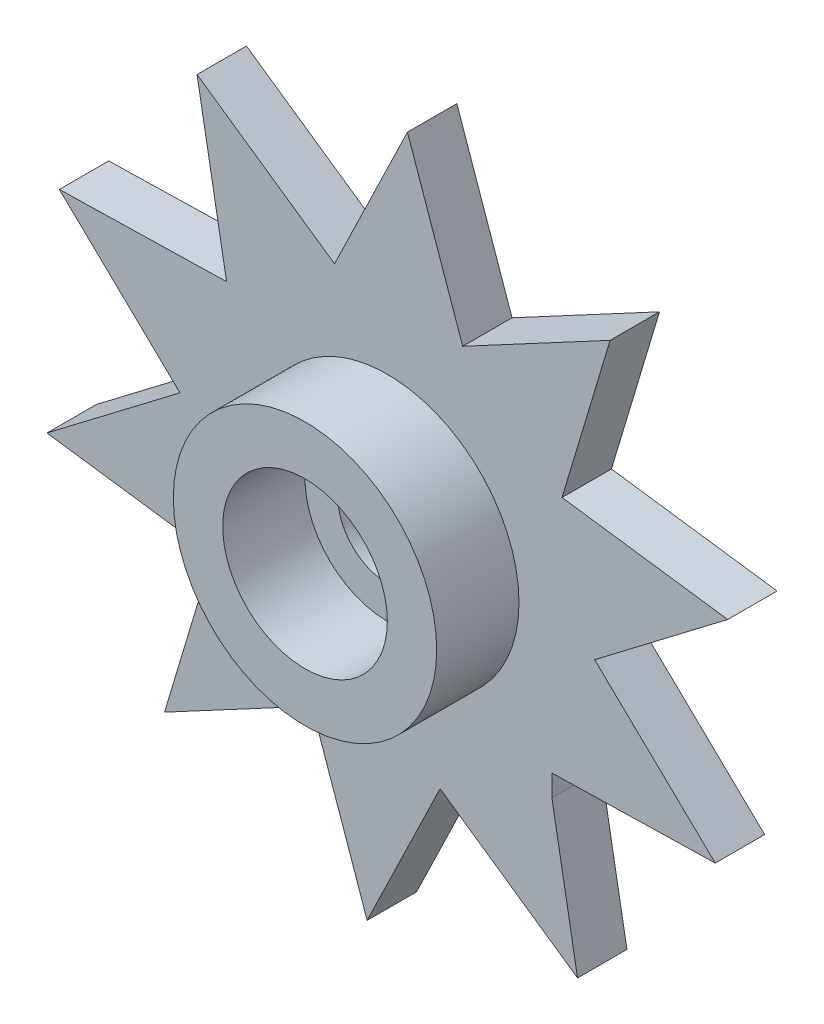
ISO-10303-21;
HEADER;
FILE_DESCRIPTION(('STEP AP214'),'2;1');
FILE_NAME('part.step','',(''),(''),'','','');
FILE_SCHEMA(('AUTOMOTIVE_DESIGN { 1 0 10303 214 1 1 1 1 }'));
ENDSEC;
DATA;
#1=APPLICATION_CONTEXT('core data for automotive mechanical design processes');
#2=APPLICATION_PROTOCOL_DEFINITION('international standard','automotive_design',2000,#1);
#3=PRODUCT_CONTEXT('',#1,'mechanical');
#4=PRODUCT('Part','Part','',(#3));
#5=PRODUCT_RELATED_PRODUCT_CATEGORY('part','',(#4));
#6=PRODUCT_DEFINITION_FORMATION('','',#4);
#7=PRODUCT_DEFINITION_CONTEXT('part definition',#1,'design');
#8=PRODUCT_DEFINITION('design','',#6,#7);
#9=PRODUCT_DEFINITION_SHAPE('','',#8);
#10=(LENGTH_UNIT() NAMED_UNIT(*) SI_UNIT(.MILLI.,.METRE.));
#11=(NAMED_UNIT(*) PLANE_ANGLE_UNIT() SI_UNIT($,.RADIAN.));
#12=(NAMED_UNIT(*) SI_UNIT($,.STERADIAN.) SOLID_ANGLE_UNIT());
#13=UNCERTAINTY_MEASURE_WITH_UNIT(LENGTH_MEASURE(1.E-05),#10,'distance_accuracy_value','');
#14=(GEOMETRIC_REPRESENTATION_CONTEXT(3) GLOBAL_UNCERTAINTY_ASSIGNED_CONTEXT((#13)) GLOBAL_UNIT_ASSIGNED_CONTEXT((#10,
#11,#12)) REPRESENTATION_CONTEXT('',''));
#15=CARTESIAN_POINT('',(0.,0.,0.));
#16=DIRECTION('',(0.,0.,1.));
#17=DIRECTION('',(1.,0.,0.));
#18=AXIS2_PLACEMENT_3D('',#15,#16,#17);
#19=CARTESIAN_POINT('',(-27.0977879554297,20.4023803394427,-1.5));
#20=DIRECTION('',(0.,0.,-1.));
#21=DIRECTION('',(-1.,0.,0.));
#22=AXIS2_PLACEMENT_3D('',#19,#20,#21);
#23=PLANE('',#22);
#24=DIRECTION('',(0.435997280474223,0.899947982618486,0.));
#25=VECTOR('',#24,1.);
#26=CARTESIAN_POINT('',(-29.312442593353,15.8310812445769,-1.5));
#27=LINE('',#26,#25);
#28=CARTESIAN_POINT('',(-29.312442593353,15.8310812445769,-1.5));
#29=VERTEX_POINT('',#28);
#30=CARTESIAN_POINT('',(-27.0977879554297,20.4023803394427,-1.5));
#31=VERTEX_POINT('',#30);
#32=EDGE_CURVE('E192',#29,#31,#27,.T.);
#33=ORIENTED_EDGE('',*,*,#32,.F.);
#34=DIRECTION('',(0.33034581233094,-0.943859970692375,0.));
#35=VECTOR('',#34,1.);
#36=CARTESIAN_POINT('',(-30.9904390360479,20.6254319343846,-1.5));
#37=LINE('',#36,#35);
#38=CARTESIAN_POINT('',(-30.9904390360479,20.6254319343846,-1.5));
#39=VERTEX_POINT('',#38);
#40=EDGE_CURVE('E185',#39,#29,#37,.T.);
#41=ORIENTED_EDGE('',*,*,#40,.F.);
#42=DIRECTION('',(0.881705360786623,0.471800441670131,0.));
#43=VECTOR('',#42,1.);
#44=CARTESIAN_POINT('',(-35.4690744729797,18.2289146042202,-1.5));
#45=LINE('',#44,#43);
#46=CARTESIAN_POINT('',(-35.4690744729797,18.2289146042202,-1.5));
#47=VERTEX_POINT('',#46);
#48=EDGE_CURVE('E253',#47,#39,#45,.T.);
#49=ORIENTED_EDGE('',*,*,#48,.F.);
#50=DIRECTION('',(-0.287531593863195,-0.95777115352807,0.));
#51=VECTOR('',#50,1.);
#52=CARTESIAN_POINT('',(-34.0085534855665,23.0939273566354,-1.5));
#53=LINE('',#52,#51);
#54=CARTESIAN_POINT('',(-34.0085534855665,23.0939273566354,-1.5));
#55=VERTEX_POINT('',#54);
#56=EDGE_CURVE('E250',#55,#47,#53,.T.);
#57=ORIENTED_EDGE('',*,*,#56,.F.);
#58=DIRECTION('',(0.990631962346079,-0.136558834127848,0.));
#59=VECTOR('',#58,1.);
#60=CARTESIAN_POINT('',(-39.0404831994656,23.7875799756322,-1.5));
#61=LINE('',#60,#59);
#62=CARTESIAN_POINT('',(-39.0404831994656,23.7875799756322,-1.5));
#63=VERTEX_POINT('',#62);
#64=EDGE_CURVE('E247',#63,#55,#61,.T.);
#65=ORIENTED_EDGE('',*,*,#64,.F.);
#66=DIRECTION('',(-0.795581704514586,-0.605846310083396,0.));
#67=VECTOR('',#66,1.);
#68=CARTESIAN_POINT('',(-34.9993141568231,26.8649852741893,-1.5));
#69=LINE('',#68,#67);
#70=CARTESIAN_POINT('',(-34.9993141568231,26.8649852741893,-1.5));
#71=VERTEX_POINT('',#70);
#72=EDGE_CURVE('E244',#71,#63,#69,.T.);
#73=ORIENTED_EDGE('',*,*,#72,.F.);
#74=DIRECTION('',(0.721170823852476,-0.692757275547461,0.));
#75=VECTOR('',#74,1.);
#76=CARTESIAN_POINT('',(-38.66251203676,30.3838561147205,-1.5));
#77=LINE('',#76,#75);
#78=CARTESIAN_POINT('',(-38.66251203676,30.3838561147205,-1.5));
#79=VERTEX_POINT('',#78);
#80=EDGE_CURVE('E241',#79,#71,#77,.T.);
#81=ORIENTED_EDGE('',*,*,#80,.F.);
#82=DIRECTION('',(-0.999746645592742,-0.0225087677596958,0.));
#83=VECTOR('',#82,1.);
#84=CARTESIAN_POINT('',(-33.5842841515882,30.4981897337449,-1.5));
#85=LINE('',#84,#83);
#86=CARTESIAN_POINT('',(-33.5842841515882,30.4981897337449,-1.5));
#87=VERTEX_POINT('',#86);
#88=EDGE_CURVE('E238',#87,#79,#85,.T.);
#89=ORIENTED_EDGE('',*,*,#88,.F.);
#90=DIRECTION('',(0.176246943085122,-0.984345983408857,0.));
#91=VECTOR('',#90,1.);
#92=CARTESIAN_POINT('',(-34.4795331066723,35.4981897204815,-1.5));
#93=LINE('',#92,#91);
#94=CARTESIAN_POINT('',(-34.4795331066723,35.4981897204815,-1.5));
#95=VERTEX_POINT('',#94);
#96=EDGE_CURVE('E235',#95,#87,#93,.T.);
#97=ORIENTED_EDGE('',*,*,#96,.F.);
#98=DIRECTION('',(-0.822042348583234,0.569426357956638,0.));
#99=VECTOR('',#98,1.);
#100=CARTESIAN_POINT('',(-30.3039568240703,32.6057801030573,-1.5));
#101=LINE('',#100,#99);
#102=CARTESIAN_POINT('',(-30.3039568240703,32.6057801030573,-1.5));
#103=VERTEX_POINT('',#102);
#104=EDGE_CURVE('E232',#103,#95,#101,.T.);
#105=ORIENTED_EDGE('',*,*,#104,.F.);
#106=DIRECTION('',(-0.435997280515322,-0.899947982598574,0.));
#107=VECTOR('',#106,1.);
#108=CARTESIAN_POINT('',(-28.089302185647,37.1770791984231,-1.5));
#109=LINE('',#108,#107);
#110=CARTESIAN_POINT('',(-28.089302185647,37.1770791984231,-1.5));
#111=VERTEX_POINT('',#110);
#112=EDGE_CURVE('E229',#111,#103,#109,.T.);
#113=ORIENTED_EDGE('',*,*,#112,.F.);
#114=DIRECTION('',(-0.330345812243248,0.943859970723067,0.));
#115=VECTOR('',#114,1.);
#116=CARTESIAN_POINT('',(-26.4113057434521,32.3827285086154,-1.5));
#117=LINE('',#116,#115);
#118=CARTESIAN_POINT('',(-26.4113057434521,32.3827285086154,-1.5));
#119=VERTEX_POINT('',#118);
#120=EDGE_CURVE('E226',#119,#111,#117,.T.);
#121=ORIENTED_EDGE('',*,*,#120,.F.);
#122=DIRECTION('',(-0.881705360827571,-0.471800441593608,0.));
#123=VECTOR('',#122,1.);
#124=CARTESIAN_POINT('',(-21.9326703065203,34.7792458382798,-1.5));
#125=LINE('',#124,#123);
#126=CARTESIAN_POINT('',(-21.9326703065203,34.7792458382798,-1.5));
#127=VERTEX_POINT('',#126);
#128=EDGE_CURVE('E223',#127,#119,#125,.T.);
#129=ORIENTED_EDGE('',*,*,#128,.F.);
#130=DIRECTION('',(0.287531593800007,0.95777115354704,0.));
#131=VECTOR('',#130,1.);
#132=CARTESIAN_POINT('',(-23.3931912934335,29.9142330863646,-1.5));
#133=LINE('',#132,#131);
#134=CARTESIAN_POINT('',(-23.3931912934335,29.9142330863646,-1.5));
#135=VERTEX_POINT('',#134);
#136=EDGE_CURVE('E220',#135,#127,#133,.T.);
#137=ORIENTED_EDGE('',*,*,#136,.F.);
#138=DIRECTION('',(-0.990631962346079,0.136558834127849,0.));
#139=VECTOR('',#138,1.);
#140=CARTESIAN_POINT('',(-18.3612615795344,29.2205804673678,-1.5));
#141=LINE('',#140,#139);
#142=CARTESIAN_POINT('',(-18.3612615795344,29.2205804673678,-1.5));
#143=VERTEX_POINT('',#142);
#144=EDGE_CURVE('E217',#143,#135,#141,.T.);
#145=ORIENTED_EDGE('',*,*,#144,.F.);
#146=DIRECTION('',(0.795581704503271,0.605846310098254,0.));
#147=VECTOR('',#146,1.);
#148=CARTESIAN_POINT('',(-22.4024306226769,26.1431751683108,-1.5));
#149=LINE('',#148,#147);
#150=CARTESIAN_POINT('',(-22.4024306226769,26.1431751683108,-1.5));
#151=VERTEX_POINT('',#150);
#152=EDGE_CURVE('E214',#151,#143,#149,.T.);
#153=ORIENTED_EDGE('',*,*,#152,.F.);
#154=DIRECTION('',(-0.721170823899714,0.692757275498285,0.));
#155=VECTOR('',#154,1.);
#156=CARTESIAN_POINT('',(-18.73923274224,22.6243043277795,-1.5));
#157=LINE('',#156,#155);
#158=CARTESIAN_POINT('',(-18.73923274224,22.6243043277795,-1.5));
#159=VERTEX_POINT('',#158);
#160=EDGE_CURVE('E211',#159,#151,#157,.T.);
#161=ORIENTED_EDGE('',*,*,#160,.F.);
#162=DIRECTION('',(0.999746645635961,0.0225087658401004,0.));
#163=VECTOR('',#162,1.);
#164=CARTESIAN_POINT('',(-23.8174606317334,22.5099707184134,-1.5));
#165=LINE('',#164,#163);
#166=CARTESIAN_POINT('',(-23.7008723899989,22.5125956408818,-1.5));
#167=VERTEX_POINT('',#166);
#168=EDGE_CURVE('E209',#167,#159,#165,.T.);
#169=ORIENTED_EDGE('',*,*,#168,.F.);
#170=DIRECTION('',(4.08548727608119E-10,1.,0.));
#171=VECTOR('',#170,1.);
#172=CARTESIAN_POINT('',(-23.700872390266,21.8588208889524,-1.5));
#173=LINE('',#172,#171);
#174=CARTESIAN_POINT('',(-23.700872390266,21.8588208889524,-1.5));
#175=VERTEX_POINT('',#174);
#176=EDGE_CURVE('E11',#167,#175,#173,.F.);
#177=ORIENTED_EDGE('',*,*,#176,.T.);
#178=DIRECTION('',(-0.176246943484241,0.984345983337395,0.));
#179=VECTOR('',#178,1.);
#180=CARTESIAN_POINT('',(-22.9222116728277,17.5099707220185,-1.5));
#181=LINE('',#180,#179);
#182=CARTESIAN_POINT('',(-22.9222116728277,17.5099707220185,-1.5));
#183=VERTEX_POINT('',#182);
#184=EDGE_CURVE('E195',#183,#175,#181,.T.);
#185=ORIENTED_EDGE('',*,*,#184,.F.);
#186=DIRECTION('',(0.822042348583234,-0.569426357956637,0.));
#187=VECTOR('',#186,1.);
#188=CARTESIAN_POINT('',(-27.0977879554297,20.4023803394427,-1.5));
#189=LINE('',#188,#187);
#190=EDGE_CURVE('E177',#31,#183,#189,.T.);
#191=ORIENTED_EDGE('',*,*,#190,.F.);
#192=EDGE_LOOP('',(#33,#41,#49,#57,#65,#73,#81,#89,#97,#105,#113,#121,#129,#137,#145,#153,#161,
#169,#177,#185,#191));
#193=FACE_BOUND('',#192,.T.);
#194=CARTESIAN_POINT('',(-28.70087239,26.504080221,-1.5));
#195=DIRECTION('',(0.,0.,1.));
#196=DIRECTION('',(1.,0.,0.));
#197=AXIS2_PLACEMENT_3D('',#194,#195,#196);
#198=CIRCLE('',#197,1.50000000000001);
#199=CARTESIAN_POINT('',(-27.20087239,26.504080221,-1.5));
#200=VERTEX_POINT('',#199);
#201=EDGE_CURVE('E660',#200,#200,#198,.T.);
#202=ORIENTED_EDGE('',*,*,#201,.T.);
#203=EDGE_LOOP('',(#202));
#204=FACE_BOUND('',#203,.T.);
#205=ADVANCED_FACE('F33',(#193,#204),#23,.T.);
#206=CARTESIAN_POINT('',(-29.312442593353,15.8310812445769,-1.5));
#207=DIRECTION('',(0.899947982618485,-0.435997280474223,0.));
#208=DIRECTION('',(0.435997280474223,0.899947982618486,0.));
#209=AXIS2_PLACEMENT_3D('',#206,#207,#208);
#210=PLANE('',#209);
#211=DIRECTION('',(0.435997280474223,0.899947982618486,0.));
#212=VECTOR('',#211,1.);
#213=CARTESIAN_POINT('',(-29.312442593353,15.8310812445769,0.));
#214=LINE('',#213,#212);
#215=CARTESIAN_POINT('',(-29.312442593353,15.8310812445769,0.));
#216=VERTEX_POINT('',#215);
#217=CARTESIAN_POINT('',(-27.0977879554297,20.4023803394427,0.));
#218=VERTEX_POINT('',#217);
#219=EDGE_CURVE('E257',#216,#218,#214,.T.);
#220=ORIENTED_EDGE('',*,*,#219,.F.);
#221=DIRECTION('',(0.,0.,1.));
#222=VECTOR('',#221,1.);
#223=CARTESIAN_POINT('',(-29.312442593353,15.8310812445769,-1.5));
#224=LINE('',#223,#222);
#225=EDGE_CURVE('E198',#29,#216,#224,.T.);
#226=ORIENTED_EDGE('',*,*,#225,.F.);
#227=ORIENTED_EDGE('',*,*,#32,.T.);
#228=DIRECTION('',(0.,0.,1.));
#229=VECTOR('',#228,1.);
#230=CARTESIAN_POINT('',(-27.0977879554297,20.4023803394427,-1.5));
#231=LINE('',#230,#229);
#232=EDGE_CURVE('E174',#31,#218,#231,.T.);
#233=ORIENTED_EDGE('',*,*,#232,.T.);
#234=EDGE_LOOP('',(#220,#226,#227,#233));
#235=FACE_BOUND('',#234,.T.);
#236=ADVANCED_FACE('F197',(#235),#210,.T.);
#237=CARTESIAN_POINT('',(-30.9904390360479,20.6254319343846,-1.5));
#238=DIRECTION('',(-0.943859970692375,-0.33034581233094,0.));
#239=DIRECTION('',(0.33034581233094,-0.943859970692375,0.));
#240=AXIS2_PLACEMENT_3D('',#237,#238,#239);
#241=PLANE('',#240);
#242=DIRECTION('',(0.33034581233094,-0.943859970692375,0.));
#243=VECTOR('',#242,1.);
#244=CARTESIAN_POINT('',(-30.9904390360479,20.6254319343846,0.));
#245=LINE('',#244,#243);
#246=CARTESIAN_POINT('',(-30.9904390360479,20.6254319343846,0.));
#247=VERTEX_POINT('',#246);
#248=EDGE_CURVE('E199',#247,#216,#245,.T.);
#249=ORIENTED_EDGE('',*,*,#248,.F.);
#250=DIRECTION('',(0.,0.,1.));
#251=VECTOR('',#250,1.);
#252=CARTESIAN_POINT('',(-30.9904390360479,20.6254319343846,-1.5));
#253=LINE('',#252,#251);
#254=EDGE_CURVE('E310',#39,#247,#253,.T.);
#255=ORIENTED_EDGE('',*,*,#254,.F.);
#256=ORIENTED_EDGE('',*,*,#40,.T.);
#257=ORIENTED_EDGE('',*,*,#225,.T.);
#258=EDGE_LOOP('',(#249,#255,#256,#257));
#259=FACE_BOUND('',#258,.T.);
#260=ADVANCED_FACE('F356',(#259),#241,.T.);
#261=CARTESIAN_POINT('',(-35.4690744729797,18.2289146042202,-1.5));
#262=DIRECTION('',(0.471800441670131,-0.881705360786623,0.));
#263=DIRECTION('',(0.881705360786623,0.471800441670131,0.));
#264=AXIS2_PLACEMENT_3D('',#261,#262,#263);
#265=PLANE('',#264);
#266=DIRECTION('',(0.881705360786623,0.471800441670131,0.));
#267=VECTOR('',#266,1.);
#268=CARTESIAN_POINT('',(-35.4690744729797,18.2289146042202,0.));
#269=LINE('',#268,#267);
#270=CARTESIAN_POINT('',(-35.4690744729797,18.2289146042202,0.));
#271=VERTEX_POINT('',#270);
#272=EDGE_CURVE('E202',#271,#247,#269,.T.);
#273=ORIENTED_EDGE('',*,*,#272,.F.);
#274=DIRECTION('',(0.,0.,1.));
#275=VECTOR('',#274,1.);
#276=CARTESIAN_POINT('',(-35.4690744729797,18.2289146042202,-1.5));
#277=LINE('',#276,#275);
#278=EDGE_CURVE('E312',#47,#271,#277,.T.);
#279=ORIENTED_EDGE('',*,*,#278,.F.);
#280=ORIENTED_EDGE('',*,*,#48,.T.);
#281=ORIENTED_EDGE('',*,*,#254,.T.);
#282=EDGE_LOOP('',(#273,#279,#280,#281));
#283=FACE_BOUND('',#282,.T.);
#284=ADVANCED_FACE('F438',(#283),#265,.T.);
#285=CARTESIAN_POINT('',(-34.0085534855665,23.0939273566354,-1.5));
#286=DIRECTION('',(-0.957771153528071,0.287531593863195,0.));
#287=DIRECTION('',(-0.287531593863195,-0.957771153528071,0.));
#288=AXIS2_PLACEMENT_3D('',#285,#286,#287);
#289=PLANE('',#288);
#290=DIRECTION('',(-0.287531593863195,-0.95777115352807,0.));
#291=VECTOR('',#290,1.);
#292=CARTESIAN_POINT('',(-34.0085534855665,23.0939273566354,0.));
#293=LINE('',#292,#291);
#294=CARTESIAN_POINT('',(-34.0085534855665,23.0939273566354,0.));
#295=VERTEX_POINT('',#294);
#296=EDGE_CURVE('E303',#295,#271,#293,.T.);
#297=ORIENTED_EDGE('',*,*,#296,.F.);
#298=DIRECTION('',(0.,0.,1.));
#299=VECTOR('',#298,1.);
#300=CARTESIAN_POINT('',(-34.0085534855665,23.0939273566354,-1.5));
#301=LINE('',#300,#299);
#302=EDGE_CURVE('E314',#55,#295,#301,.T.);
#303=ORIENTED_EDGE('',*,*,#302,.F.);
#304=ORIENTED_EDGE('',*,*,#56,.T.);
#305=ORIENTED_EDGE('',*,*,#278,.T.);
#306=EDGE_LOOP('',(#297,#303,#304,#305));
#307=FACE_BOUND('',#306,.T.);
#308=ADVANCED_FACE('F363',(#307),#289,.T.);
#309=CARTESIAN_POINT('',(-39.0404831994656,23.7875799756322,-1.5));
#310=DIRECTION('',(-0.136558834127848,-0.990631962346079,0.));
#311=DIRECTION('',(0.990631962346079,-0.136558834127848,0.));
#312=AXIS2_PLACEMENT_3D('',#309,#310,#311);
#313=PLANE('',#312);
#314=DIRECTION('',(0.990631962346079,-0.136558834127848,0.));
#315=VECTOR('',#314,1.);
#316=CARTESIAN_POINT('',(-39.0404831994656,23.7875799756322,0.));
#317=LINE('',#316,#315);
#318=CARTESIAN_POINT('',(-39.0404831994656,23.7875799756322,0.));
#319=VERTEX_POINT('',#318);
#320=EDGE_CURVE('E300',#319,#295,#317,.T.);
#321=ORIENTED_EDGE('',*,*,#320,.F.);
#322=DIRECTION('',(0.,0.,1.));
#323=VECTOR('',#322,1.);
#324=CARTESIAN_POINT('',(-39.0404831994656,23.7875799756322,-1.5));
#325=LINE('',#324,#323);
#326=EDGE_CURVE('E316',#63,#319,#325,.T.);
#327=ORIENTED_EDGE('',*,*,#326,.F.);
#328=ORIENTED_EDGE('',*,*,#64,.T.);
#329=ORIENTED_EDGE('',*,*,#302,.T.);
#330=EDGE_LOOP('',(#321,#327,#328,#329));
#331=FACE_BOUND('',#330,.T.);
#332=ADVANCED_FACE('F366',(#331),#313,.T.);
#333=CARTESIAN_POINT('',(-34.9993141568231,26.8649852741893,-1.5));
#334=DIRECTION('',(-0.605846310083396,0.795581704514586,0.));
#335=DIRECTION('',(-0.795581704514586,-0.605846310083396,0.));
#336=AXIS2_PLACEMENT_3D('',#333,#334,#335);
#337=PLANE('',#336);
#338=DIRECTION('',(-0.795581704514586,-0.605846310083396,0.));
#339=VECTOR('',#338,1.);
#340=CARTESIAN_POINT('',(-34.9993141568231,26.8649852741893,0.));
#341=LINE('',#340,#339);
#342=CARTESIAN_POINT('',(-34.9993141568231,26.8649852741893,0.));
#343=VERTEX_POINT('',#342);
#344=EDGE_CURVE('E297',#343,#319,#341,.T.);
#345=ORIENTED_EDGE('',*,*,#344,.F.);
#346=DIRECTION('',(0.,0.,1.));
#347=VECTOR('',#346,1.);
#348=CARTESIAN_POINT('',(-34.9993141568231,26.8649852741893,-1.5));
#349=LINE('',#348,#347);
#350=EDGE_CURVE('E318',#71,#343,#349,.T.);
#351=ORIENTED_EDGE('',*,*,#350,.F.);
#352=ORIENTED_EDGE('',*,*,#72,.T.);
#353=ORIENTED_EDGE('',*,*,#326,.T.);
#354=EDGE_LOOP('',(#345,#351,#352,#353));
#355=FACE_BOUND('',#354,.T.);
#356=ADVANCED_FACE('F371',(#355),#337,.T.);
#357=CARTESIAN_POINT('',(-38.66251203676,30.3838561147205,-1.5));
#358=DIRECTION('',(-0.692757275547461,-0.721170823852476,0.));
#359=DIRECTION('',(0.721170823852476,-0.692757275547461,0.));
#360=AXIS2_PLACEMENT_3D('',#357,#358,#359);
#361=PLANE('',#360);
#362=DIRECTION('',(0.721170823852476,-0.692757275547461,0.));
#363=VECTOR('',#362,1.);
#364=CARTESIAN_POINT('',(-38.66251203676,30.3838561147205,0.));
#365=LINE('',#364,#363);
#366=CARTESIAN_POINT('',(-38.66251203676,30.3838561147205,0.));
#367=VERTEX_POINT('',#366);
#368=EDGE_CURVE('E294',#367,#343,#365,.T.);
#369=ORIENTED_EDGE('',*,*,#368,.F.);
#370=DIRECTION('',(0.,0.,1.));
#371=VECTOR('',#370,1.);
#372=CARTESIAN_POINT('',(-38.66251203676,30.3838561147205,-1.5));
#373=LINE('',#372,#371);
#374=EDGE_CURVE('E320',#79,#367,#373,.T.);
#375=ORIENTED_EDGE('',*,*,#374,.F.);
#376=ORIENTED_EDGE('',*,*,#80,.T.);
#377=ORIENTED_EDGE('',*,*,#350,.T.);
#378=EDGE_LOOP('',(#369,#375,#376,#377));
#379=FACE_BOUND('',#378,.T.);
#380=ADVANCED_FACE('F374',(#379),#361,.T.);
#381=CARTESIAN_POINT('',(-33.5842841515882,30.4981897337449,-1.5));
#382=DIRECTION('',(-0.0225087677596958,0.999746645592742,0.));
#383=DIRECTION('',(-0.999746645592742,-0.0225087677596958,0.));
#384=AXIS2_PLACEMENT_3D('',#381,#382,#383);
#385=PLANE('',#384);
#386=DIRECTION('',(-0.999746645592742,-0.0225087677596958,0.));
#387=VECTOR('',#386,1.);
#388=CARTESIAN_POINT('',(-33.5842841515882,30.4981897337449,0.));
#389=LINE('',#388,#387);
#390=CARTESIAN_POINT('',(-33.5842841515882,30.4981897337449,0.));
#391=VERTEX_POINT('',#390);
#392=EDGE_CURVE('E291',#391,#367,#389,.T.);
#393=ORIENTED_EDGE('',*,*,#392,.F.);
#394=DIRECTION('',(0.,0.,1.));
#395=VECTOR('',#394,1.);
#396=CARTESIAN_POINT('',(-33.5842841515882,30.4981897337449,-1.5));
#397=LINE('',#396,#395);
#398=EDGE_CURVE('E322',#87,#391,#397,.T.);
#399=ORIENTED_EDGE('',*,*,#398,.F.);
#400=ORIENTED_EDGE('',*,*,#88,.T.);
#401=ORIENTED_EDGE('',*,*,#374,.T.);
#402=EDGE_LOOP('',(#393,#399,#400,#401));
#403=FACE_BOUND('',#402,.T.);
#404=ADVANCED_FACE('F379',(#403),#385,.T.);
#405=CARTESIAN_POINT('',(-34.4795331066723,35.4981897204815,-1.5));
#406=DIRECTION('',(-0.984345983408857,-0.176246943085122,0.));
#407=DIRECTION('',(0.176246943085122,-0.984345983408857,0.));
#408=AXIS2_PLACEMENT_3D('',#405,#406,#407);
#409=PLANE('',#408);
#410=DIRECTION('',(0.176246943085122,-0.984345983408857,0.));
#411=VECTOR('',#410,1.);
#412=CARTESIAN_POINT('',(-34.4795331066723,35.4981897204815,0.));
#413=LINE('',#412,#411);
#414=CARTESIAN_POINT('',(-34.4795331066723,35.4981897204815,0.));
#415=VERTEX_POINT('',#414);
#416=EDGE_CURVE('E288',#415,#391,#413,.T.);
#417=ORIENTED_EDGE('',*,*,#416,.F.);
#418=DIRECTION('',(0.,0.,1.));
#419=VECTOR('',#418,1.);
#420=CARTESIAN_POINT('',(-34.4795331066723,35.4981897204815,-1.5));
#421=LINE('',#420,#419);
#422=EDGE_CURVE('E324',#95,#415,#421,.T.);
#423=ORIENTED_EDGE('',*,*,#422,.F.);
#424=ORIENTED_EDGE('',*,*,#96,.T.);
#425=ORIENTED_EDGE('',*,*,#398,.T.);
#426=EDGE_LOOP('',(#417,#423,#424,#425));
#427=FACE_BOUND('',#426,.T.);
#428=ADVANCED_FACE('F382',(#427),#409,.T.);
#429=CARTESIAN_POINT('',(-30.3039568240703,32.6057801030573,-1.5));
#430=DIRECTION('',(0.569426357956638,0.822042348583234,0.));
#431=DIRECTION('',(-0.822042348583234,0.569426357956638,0.));
#432=AXIS2_PLACEMENT_3D('',#429,#430,#431);
#433=PLANE('',#432);
#434=DIRECTION('',(-0.822042348583234,0.569426357956638,0.));
#435=VECTOR('',#434,1.);
#436=CARTESIAN_POINT('',(-30.3039568240703,32.6057801030573,0.));
#437=LINE('',#436,#435);
#438=CARTESIAN_POINT('',(-30.3039568240703,32.6057801030573,0.));
#439=VERTEX_POINT('',#438);
#440=EDGE_CURVE('E285',#439,#415,#437,.T.);
#441=ORIENTED_EDGE('',*,*,#440,.F.);
#442=DIRECTION('',(0.,0.,1.));
#443=VECTOR('',#442,1.);
#444=CARTESIAN_POINT('',(-30.3039568240703,32.6057801030573,-1.5));
#445=LINE('',#444,#443);
#446=EDGE_CURVE('E326',#103,#439,#445,.T.);
#447=ORIENTED_EDGE('',*,*,#446,.F.);
#448=ORIENTED_EDGE('',*,*,#104,.T.);
#449=ORIENTED_EDGE('',*,*,#422,.T.);
#450=EDGE_LOOP('',(#441,#447,#448,#449));
#451=FACE_BOUND('',#450,.T.);
#452=ADVANCED_FACE('F387',(#451),#433,.T.);
#453=CARTESIAN_POINT('',(-28.089302185647,37.1770791984231,-1.5));
#454=DIRECTION('',(-0.899947982598574,0.435997280515322,0.));
#455=DIRECTION('',(-0.435997280515322,-0.899947982598574,0.));
#456=AXIS2_PLACEMENT_3D('',#453,#454,#455);
#457=PLANE('',#456);
#458=DIRECTION('',(-0.435997280515322,-0.899947982598574,0.));
#459=VECTOR('',#458,1.);
#460=CARTESIAN_POINT('',(-28.089302185647,37.1770791984231,0.));
#461=LINE('',#460,#459);
#462=CARTESIAN_POINT('',(-28.089302185647,37.1770791984231,0.));
#463=VERTEX_POINT('',#462);
#464=EDGE_CURVE('E282',#463,#439,#461,.T.);
#465=ORIENTED_EDGE('',*,*,#464,.F.);
#466=DIRECTION('',(0.,0.,1.));
#467=VECTOR('',#466,1.);
#468=CARTESIAN_POINT('',(-28.089302185647,37.1770791984231,-1.5));
#469=LINE('',#468,#467);
#470=EDGE_CURVE('E328',#111,#463,#469,.T.);
#471=ORIENTED_EDGE('',*,*,#470,.F.);
#472=ORIENTED_EDGE('',*,*,#112,.T.);
#473=ORIENTED_EDGE('',*,*,#446,.T.);
#474=EDGE_LOOP('',(#465,#471,#472,#473));
#475=FACE_BOUND('',#474,.T.);
#476=ADVANCED_FACE('F390',(#475),#457,.T.);
#477=CARTESIAN_POINT('',(-26.4113057434521,32.3827285086154,-1.5));
#478=DIRECTION('',(0.943859970723067,0.330345812243248,0.));
#479=DIRECTION('',(-0.330345812243248,0.943859970723067,0.));
#480=AXIS2_PLACEMENT_3D('',#477,#478,#479);
#481=PLANE('',#480);
#482=DIRECTION('',(-0.330345812243248,0.943859970723067,0.));
#483=VECTOR('',#482,1.);
#484=CARTESIAN_POINT('',(-26.4113057434521,32.3827285086154,0.));
#485=LINE('',#484,#483);
#486=CARTESIAN_POINT('',(-26.4113057434521,32.3827285086154,0.));
#487=VERTEX_POINT('',#486);
#488=EDGE_CURVE('E279',#487,#463,#485,.T.);
#489=ORIENTED_EDGE('',*,*,#488,.F.);
#490=DIRECTION('',(0.,0.,1.));
#491=VECTOR('',#490,1.);
#492=CARTESIAN_POINT('',(-26.4113057434521,32.3827285086154,-1.5));
#493=LINE('',#492,#491);
#494=EDGE_CURVE('E330',#119,#487,#493,.T.);
#495=ORIENTED_EDGE('',*,*,#494,.F.);
#496=ORIENTED_EDGE('',*,*,#120,.T.);
#497=ORIENTED_EDGE('',*,*,#470,.T.);
#498=EDGE_LOOP('',(#489,#495,#496,#497));
#499=FACE_BOUND('',#498,.T.);
#500=ADVANCED_FACE('F395',(#499),#481,.T.);
#501=CARTESIAN_POINT('',(-21.9326703065203,34.7792458382798,-1.5));
#502=DIRECTION('',(-0.471800441593608,0.881705360827571,0.));
#503=DIRECTION('',(-0.881705360827571,-0.471800441593608,0.));
#504=AXIS2_PLACEMENT_3D('',#501,#502,#503);
#505=PLANE('',#504);
#506=DIRECTION('',(-0.881705360827571,-0.471800441593608,0.));
#507=VECTOR('',#506,1.);
#508=CARTESIAN_POINT('',(-21.9326703065203,34.7792458382798,0.));
#509=LINE('',#508,#507);
#510=CARTESIAN_POINT('',(-21.9326703065203,34.7792458382798,0.));
#511=VERTEX_POINT('',#510);
#512=EDGE_CURVE('E276',#511,#487,#509,.T.);
#513=ORIENTED_EDGE('',*,*,#512,.F.);
#514=DIRECTION('',(0.,0.,1.));
#515=VECTOR('',#514,1.);
#516=CARTESIAN_POINT('',(-21.9326703065203,34.7792458382798,-1.5));
#517=LINE('',#516,#515);
#518=EDGE_CURVE('E332',#127,#511,#517,.T.);
#519=ORIENTED_EDGE('',*,*,#518,.F.);
#520=ORIENTED_EDGE('',*,*,#128,.T.);
#521=ORIENTED_EDGE('',*,*,#494,.T.);
#522=EDGE_LOOP('',(#513,#519,#520,#521));
#523=FACE_BOUND('',#522,.T.);
#524=ADVANCED_FACE('F398',(#523),#505,.T.);
#525=CARTESIAN_POINT('',(-23.3931912934335,29.9142330863646,-1.5));
#526=DIRECTION('',(0.95777115354704,-0.287531593800007,0.));
#527=DIRECTION('',(0.287531593800007,0.95777115354704,0.));
#528=AXIS2_PLACEMENT_3D('',#525,#526,#527);
#529=PLANE('',#528);
#530=DIRECTION('',(0.287531593800007,0.95777115354704,0.));
#531=VECTOR('',#530,1.);
#532=CARTESIAN_POINT('',(-23.3931912934335,29.9142330863646,0.));
#533=LINE('',#532,#531);
#534=CARTESIAN_POINT('',(-23.3931912934335,29.9142330863646,0.));
#535=VERTEX_POINT('',#534);
#536=EDGE_CURVE('E273',#535,#511,#533,.T.);
#537=ORIENTED_EDGE('',*,*,#536,.F.);
#538=DIRECTION('',(0.,0.,1.));
#539=VECTOR('',#538,1.);
#540=CARTESIAN_POINT('',(-23.3931912934335,29.9142330863646,-1.5));
#541=LINE('',#540,#539);
#542=EDGE_CURVE('E334',#135,#535,#541,.T.);
#543=ORIENTED_EDGE('',*,*,#542,.F.);
#544=ORIENTED_EDGE('',*,*,#136,.T.);
#545=ORIENTED_EDGE('',*,*,#518,.T.);
#546=EDGE_LOOP('',(#537,#543,#544,#545));
#547=FACE_BOUND('',#546,.T.);
#548=ADVANCED_FACE('F403',(#547),#529,.T.);
#549=CARTESIAN_POINT('',(-18.3612615795344,29.2205804673678,-1.5));
#550=DIRECTION('',(0.136558834127849,0.990631962346079,0.));
#551=DIRECTION('',(-0.990631962346079,0.136558834127849,0.));
#552=AXIS2_PLACEMENT_3D('',#549,#550,#551);
#553=PLANE('',#552);
#554=DIRECTION('',(-0.990631962346079,0.136558834127849,0.));
#555=VECTOR('',#554,1.);
#556=CARTESIAN_POINT('',(-18.3612615795344,29.2205804673678,0.));
#557=LINE('',#556,#555);
#558=CARTESIAN_POINT('',(-18.3612615795344,29.2205804673678,0.));
#559=VERTEX_POINT('',#558);
#560=EDGE_CURVE('E270',#559,#535,#557,.T.);
#561=ORIENTED_EDGE('',*,*,#560,.F.);
#562=DIRECTION('',(0.,0.,1.));
#563=VECTOR('',#562,1.);
#564=CARTESIAN_POINT('',(-18.3612615795344,29.2205804673678,-1.5));
#565=LINE('',#564,#563);
#566=EDGE_CURVE('E336',#143,#559,#565,.T.);
#567=ORIENTED_EDGE('',*,*,#566,.F.);
#568=ORIENTED_EDGE('',*,*,#144,.T.);
#569=ORIENTED_EDGE('',*,*,#542,.T.);
#570=EDGE_LOOP('',(#561,#567,#568,#569));
#571=FACE_BOUND('',#570,.T.);
#572=ADVANCED_FACE('F406',(#571),#553,.T.);
#573=CARTESIAN_POINT('',(-22.4024306226769,26.1431751683108,-1.5));
#574=DIRECTION('',(0.605846310098254,-0.795581704503271,0.));
#575=DIRECTION('',(0.795581704503271,0.605846310098254,0.));
#576=AXIS2_PLACEMENT_3D('',#573,#574,#575);
#577=PLANE('',#576);
#578=DIRECTION('',(0.795581704503271,0.605846310098254,0.));
#579=VECTOR('',#578,1.);
#580=CARTESIAN_POINT('',(-22.4024306226769,26.1431751683108,0.));
#581=LINE('',#580,#579);
#582=CARTESIAN_POINT('',(-22.4024306226769,26.1431751683108,0.));
#583=VERTEX_POINT('',#582);
#584=EDGE_CURVE('E267',#583,#559,#581,.T.);
#585=ORIENTED_EDGE('',*,*,#584,.F.);
#586=DIRECTION('',(0.,0.,1.));
#587=VECTOR('',#586,1.);
#588=CARTESIAN_POINT('',(-22.4024306226769,26.1431751683108,-1.5));
#589=LINE('',#588,#587);
#590=EDGE_CURVE('E338',#151,#583,#589,.T.);
#591=ORIENTED_EDGE('',*,*,#590,.F.);
#592=ORIENTED_EDGE('',*,*,#152,.T.);
#593=ORIENTED_EDGE('',*,*,#566,.T.);
#594=EDGE_LOOP('',(#585,#591,#592,#593));
#595=FACE_BOUND('',#594,.T.);
#596=ADVANCED_FACE('F411',(#595),#577,.T.);
#597=CARTESIAN_POINT('',(-18.73923274224,22.6243043277795,-1.5));
#598=DIRECTION('',(0.692757275498285,0.721170823899714,0.));
#599=DIRECTION('',(-0.721170823899714,0.692757275498285,0.));
#600=AXIS2_PLACEMENT_3D('',#597,#598,#599);
#601=PLANE('',#600);
#602=DIRECTION('',(-0.721170823899714,0.692757275498285,0.));
#603=VECTOR('',#602,1.);
#604=CARTESIAN_POINT('',(-18.73923274224,22.6243043277795,0.));
#605=LINE('',#604,#603);
#606=CARTESIAN_POINT('',(-18.73923274224,22.6243043277795,0.));
#607=VERTEX_POINT('',#606);
#608=EDGE_CURVE('E264',#607,#583,#605,.T.);
#609=ORIENTED_EDGE('',*,*,#608,.F.);
#610=DIRECTION('',(0.,0.,1.));
#611=VECTOR('',#610,1.);
#612=CARTESIAN_POINT('',(-18.73923274224,22.6243043277795,-1.5));
#613=LINE('',#612,#611);
#614=EDGE_CURVE('E340',#159,#607,#613,.T.);
#615=ORIENTED_EDGE('',*,*,#614,.F.);
#616=ORIENTED_EDGE('',*,*,#160,.T.);
#617=ORIENTED_EDGE('',*,*,#590,.T.);
#618=EDGE_LOOP('',(#609,#615,#616,#617));
#619=FACE_BOUND('',#618,.T.);
#620=ADVANCED_FACE('F414',(#619),#601,.T.);
#621=CARTESIAN_POINT('',(-23.8174606317334,22.5099707184134,-1.5));
#622=DIRECTION('',(0.0225087658401004,-0.999746645635961,0.));
#623=DIRECTION('',(0.999746645635961,0.0225087658401004,0.));
#624=AXIS2_PLACEMENT_3D('',#621,#622,#623);
#625=PLANE('',#624);
#626=DIRECTION('',(0.999746645635961,0.0225087658401004,0.));
#627=VECTOR('',#626,1.);
#628=CARTESIAN_POINT('',(-23.8174606317334,22.5099707184134,0.));
#629=LINE('',#628,#627);
#630=CARTESIAN_POINT('',(-23.7008723899989,22.5125956408818,0.));
#631=VERTEX_POINT('',#630);
#632=EDGE_CURVE('E262',#631,#607,#629,.T.);
#633=ORIENTED_EDGE('',*,*,#632,.F.);
#634=DIRECTION('',(0.,0.,-1.));
#635=VECTOR('',#634,1.);
#636=CARTESIAN_POINT('',(-23.7008723899989,22.5125956408818,-1.5));
#637=LINE('',#636,#635);
#638=EDGE_CURVE('E48',#631,#167,#637,.T.);
#639=ORIENTED_EDGE('',*,*,#638,.T.);
#640=ORIENTED_EDGE('',*,*,#168,.T.);
#641=ORIENTED_EDGE('',*,*,#614,.T.);
#642=EDGE_LOOP('',(#633,#639,#640,#641));
#643=FACE_BOUND('',#642,.T.);
#644=ADVANCED_FACE('F469',(#643),#625,.T.);
#645=CARTESIAN_POINT('',(-22.9222116728277,17.5099707220185,-1.5));
#646=DIRECTION('',(0.984345983337395,0.176246943484241,0.));
#647=DIRECTION('',(-0.176246943484241,0.984345983337395,0.));
#648=AXIS2_PLACEMENT_3D('',#645,#646,#647);
#649=PLANE('',#648);
#650=ORIENTED_EDGE('',*,*,#184,.T.);
#651=DIRECTION('',(0.,0.,1.));
#652=VECTOR('',#651,1.);
#653=CARTESIAN_POINT('',(-23.700872390266,21.8588208889524,0.));
#654=LINE('',#653,#652);
#655=CARTESIAN_POINT('',(-23.700872390266,21.8588208889524,0.));
#656=VERTEX_POINT('',#655);
#657=EDGE_CURVE('E309',#175,#656,#654,.T.);
#658=ORIENTED_EDGE('',*,*,#657,.T.);
#659=DIRECTION('',(-0.176246943484241,0.984345983337395,0.));
#660=VECTOR('',#659,1.);
#661=CARTESIAN_POINT('',(-22.9222116728277,17.5099707220185,0.));
#662=LINE('',#661,#660);
#663=CARTESIAN_POINT('',(-22.9222116728277,17.5099707220185,0.));
#664=VERTEX_POINT('',#663);
#665=EDGE_CURVE('E260',#664,#656,#662,.T.);
#666=ORIENTED_EDGE('',*,*,#665,.F.);
#667=DIRECTION('',(0.,0.,1.));
#668=VECTOR('',#667,1.);
#669=CARTESIAN_POINT('',(-22.9222116728277,17.5099707220185,-1.5));
#670=LINE('',#669,#668);
#671=EDGE_CURVE('E184',#183,#664,#670,.T.);
#672=ORIENTED_EDGE('',*,*,#671,.F.);
#673=EDGE_LOOP('',(#650,#658,#666,#672));
#674=FACE_BOUND('',#673,.T.);
#675=ADVANCED_FACE('F349',(#674),#649,.T.);
#676=CARTESIAN_POINT('',(-27.0977879554297,20.4023803394427,-1.5));
#677=DIRECTION('',(-0.569426357956637,-0.822042348583234,0.));
#678=DIRECTION('',(0.822042348583234,-0.569426357956637,0.));
#679=AXIS2_PLACEMENT_3D('',#676,#677,#678);
#680=PLANE('',#679);
#681=DIRECTION('',(0.822042348583234,-0.569426357956637,0.));
#682=VECTOR('',#681,1.);
#683=CARTESIAN_POINT('',(-27.0977879554297,20.4023803394427,0.));
#684=LINE('',#683,#682);
#685=EDGE_CURVE('E179',#218,#664,#684,.T.);
#686=ORIENTED_EDGE('',*,*,#685,.F.);
#687=ORIENTED_EDGE('',*,*,#232,.F.);
#688=ORIENTED_EDGE('',*,*,#190,.T.);
#689=ORIENTED_EDGE('',*,*,#671,.T.);
#690=EDGE_LOOP('',(#686,#687,#688,#689));
#691=FACE_BOUND('',#690,.T.);
#692=ADVANCED_FACE('F176',(#691),#680,.T.);
#693=CARTESIAN_POINT('',(-27.0977879554297,20.4023803394427,0.));
#694=DIRECTION('',(0.,0.,-1.));
#695=DIRECTION('',(-1.,0.,0.));
#696=AXIS2_PLACEMENT_3D('',#693,#694,#695);
#697=PLANE('',#696);
#698=CARTESIAN_POINT('',(-28.70087239,26.504080221,0.));
#699=DIRECTION('',(0.,0.,-1.));
#700=DIRECTION('',(-1.,0.,0.));
#701=AXIS2_PLACEMENT_3D('',#698,#699,#700);
#702=CIRCLE('',#701,4.00000000000001);
#703=CARTESIAN_POINT('',(-32.70087239,26.504080221,0.));
#704=VERTEX_POINT('',#703);
#705=EDGE_CURVE('E666',#704,#704,#702,.T.);
#706=ORIENTED_EDGE('',*,*,#705,.T.);
#707=EDGE_LOOP('',(#706));
#708=FACE_BOUND('',#707,.T.);
#709=ORIENTED_EDGE('',*,*,#219,.T.);
#710=ORIENTED_EDGE('',*,*,#685,.T.);
#711=ORIENTED_EDGE('',*,*,#665,.T.);
#712=DIRECTION('',(-4.08548727608119E-10,-1.,0.));
#713=VECTOR('',#712,1.);
#714=CARTESIAN_POINT('',(-23.7008723908611,20.4023803380549,0.));
#715=LINE('',#714,#713);
#716=EDGE_CURVE('E41',#656,#631,#715,.F.);
#717=ORIENTED_EDGE('',*,*,#716,.T.);
#718=ORIENTED_EDGE('',*,*,#632,.T.);
#719=ORIENTED_EDGE('',*,*,#608,.T.);
#720=ORIENTED_EDGE('',*,*,#584,.T.);
#721=ORIENTED_EDGE('',*,*,#560,.T.);
#722=ORIENTED_EDGE('',*,*,#536,.T.);
#723=ORIENTED_EDGE('',*,*,#512,.T.);
#724=ORIENTED_EDGE('',*,*,#488,.T.);
#725=ORIENTED_EDGE('',*,*,#464,.T.);
#726=ORIENTED_EDGE('',*,*,#440,.T.);
#727=ORIENTED_EDGE('',*,*,#416,.T.);
#728=ORIENTED_EDGE('',*,*,#392,.T.);
#729=ORIENTED_EDGE('',*,*,#368,.T.);
#730=ORIENTED_EDGE('',*,*,#344,.T.);
#731=ORIENTED_EDGE('',*,*,#320,.T.);
#732=ORIENTED_EDGE('',*,*,#296,.T.);
#733=ORIENTED_EDGE('',*,*,#272,.T.);
#734=ORIENTED_EDGE('',*,*,#248,.T.);
#735=EDGE_LOOP('',(#709,#710,#711,#717,#718,#719,#720,#721,#722,#723,#724,#725,#726,#727,#728,
#729,#730,#731,#732,#733,#734));
#736=FACE_BOUND('',#735,.T.);
#737=ADVANCED_FACE('F352',(#708,#736),#697,.F.);
#738=CARTESIAN_POINT('',(-28.70087239,26.504080221,2.5));
#739=DIRECTION('',(0.,0.,-1.));
#740=DIRECTION('',(-1.,0.,0.));
#741=AXIS2_PLACEMENT_3D('',#738,#739,#740);
#742=CYLINDRICAL_SURFACE('',#741,4.00000000000001);
#743=CARTESIAN_POINT('',(-28.70087239,26.504080221,2.5));
#744=DIRECTION('',(0.,0.,-1.));
#745=DIRECTION('',(-1.,0.,0.));
#746=AXIS2_PLACEMENT_3D('',#743,#744,#745);
#747=CIRCLE('',#746,4.00000000000001);
#748=CARTESIAN_POINT('',(-32.70087239,26.504080221,2.5));
#749=VERTEX_POINT('',#748);
#750=EDGE_CURVE('E205',#749,#749,#747,.T.);
#751=ORIENTED_EDGE('',*,*,#750,.T.);
#752=EDGE_LOOP('',(#751));
#753=FACE_BOUND('',#752,.T.);
#754=ORIENTED_EDGE('',*,*,#705,.F.);
#755=EDGE_LOOP('',(#754));
#756=FACE_BOUND('',#755,.T.);
#757=ADVANCED_FACE('F431',(#753,#756),#742,.T.);
#758=CARTESIAN_POINT('',(-24.70087239,26.504080221,2.5));
#759=DIRECTION('',(0.,0.,1.));
#760=DIRECTION('',(1.,0.,0.));
#761=AXIS2_PLACEMENT_3D('',#758,#759,#760);
#762=PLANE('',#761);
#763=CARTESIAN_POINT('',(-28.70087239,26.504080221,2.5));
#764=DIRECTION('',(0.,0.,1.));
#765=DIRECTION('',(1.,0.,0.));
#766=AXIS2_PLACEMENT_3D('',#763,#764,#765);
#767=CIRCLE('',#766,2.5);
#768=CARTESIAN_POINT('',(-26.20087239,26.504080221,2.5));
#769=VERTEX_POINT('',#768);
#770=EDGE_CURVE('E658',#769,#769,#767,.T.);
#771=ORIENTED_EDGE('',*,*,#770,.F.);
#772=EDGE_LOOP('',(#771));
#773=FACE_BOUND('',#772,.T.);
#774=ORIENTED_EDGE('',*,*,#750,.F.);
#775=EDGE_LOOP('',(#774));
#776=FACE_BOUND('',#775,.T.);
#777=ADVANCED_FACE('F490',(#773,#776),#762,.T.);
#778=CARTESIAN_POINT('',(-28.70087239,26.504080221,2.5));
#779=DIRECTION('',(0.,0.,1.));
#780=DIRECTION('',(1.,0.,0.));
#781=AXIS2_PLACEMENT_3D('',#778,#779,#780);
#782=CYLINDRICAL_SURFACE('',#781,1.50000000000001);
#783=ORIENTED_EDGE('',*,*,#201,.F.);
#784=EDGE_LOOP('',(#783));
#785=FACE_BOUND('',#784,.T.);
#786=CARTESIAN_POINT('',(-28.70087239,26.504080221,0.));
#787=DIRECTION('',(0.,0.,1.));
#788=DIRECTION('',(1.,0.,0.));
#789=AXIS2_PLACEMENT_3D('',#786,#787,#788);
#790=CIRCLE('',#789,1.50000000000001);
#791=CARTESIAN_POINT('',(-27.20087239,26.504080221,0.));
#792=VERTEX_POINT('',#791);
#793=EDGE_CURVE('E654',#792,#792,#790,.T.);
#794=ORIENTED_EDGE('',*,*,#793,.T.);
#795=EDGE_LOOP('',(#794));
#796=FACE_BOUND('',#795,.T.);
#797=ADVANCED_FACE('F497',(#785,#796),#782,.F.);
#798=CARTESIAN_POINT('',(-27.20087239,26.504080221,0.));
#799=DIRECTION('',(0.,0.,-1.));
#800=DIRECTION('',(-1.,0.,0.));
#801=AXIS2_PLACEMENT_3D('',#798,#799,#800);
#802=PLANE('',#801);
#803=ORIENTED_EDGE('',*,*,#793,.F.);
#804=EDGE_LOOP('',(#803));
#805=FACE_BOUND('',#804,.T.);
#806=CARTESIAN_POINT('',(-28.70087239,26.504080221,0.));
#807=DIRECTION('',(0.,0.,1.));
#808=DIRECTION('',(1.,0.,0.));
#809=AXIS2_PLACEMENT_3D('',#806,#807,#808);
#810=CIRCLE('',#809,2.5);
#811=CARTESIAN_POINT('',(-26.20087239,26.504080221,0.));
#812=VERTEX_POINT('',#811);
#813=EDGE_CURVE('E657',#812,#812,#810,.T.);
#814=ORIENTED_EDGE('',*,*,#813,.T.);
#815=EDGE_LOOP('',(#814));
#816=FACE_BOUND('',#815,.T.);
#817=ADVANCED_FACE('F421',(#805,#816),#802,.F.);
#818=CARTESIAN_POINT('',(-28.70087239,26.504080221,2.5));
#819=DIRECTION('',(0.,0.,1.));
#820=DIRECTION('',(1.,0.,0.));
#821=AXIS2_PLACEMENT_3D('',#818,#819,#820);
#822=CYLINDRICAL_SURFACE('',#821,2.5);
#823=ORIENTED_EDGE('',*,*,#813,.F.);
#824=EDGE_LOOP('',(#823));
#825=FACE_BOUND('',#824,.T.);
#826=ORIENTED_EDGE('',*,*,#770,.T.);
#827=EDGE_LOOP('',(#826));
#828=FACE_BOUND('',#827,.T.);
#829=ADVANCED_FACE('F417',(#825,#828),#822,.F.);
#830=CARTESIAN_POINT('',(-23.700872390266,21.8588208889524,-1.5));
#831=DIRECTION('',(1.,-4.08548727608119E-10,0.));
#832=DIRECTION('',(4.08548727608119E-10,1.,0.));
#833=AXIS2_PLACEMENT_3D('',#830,#831,#832);
#834=PLANE('',#833);
#835=ORIENTED_EDGE('',*,*,#176,.F.);
#836=ORIENTED_EDGE('',*,*,#638,.F.);
#837=ORIENTED_EDGE('',*,*,#716,.F.);
#838=ORIENTED_EDGE('',*,*,#657,.F.);
#839=EDGE_LOOP('',(#835,#836,#837,#838));
#840=FACE_BOUND('',#839,.T.);
#841=ADVANCED_FACE('F35',(#840),#834,.T.);
#842=CLOSED_SHELL('',(#205,#236,#260,#284,#308,#332,#356,#380,#404,#428,#452,#476,#500,#524,
#548,#572,#596,#620,#644,#675,#692,#737,#757,#777,#797,#817,#829,#841));
#843=MANIFOLD_SOLID_BREP('B2',#842);
#844=ADVANCED_BREP_SHAPE_REPRESENTATION('',(#18,#843),#14);
#845=SHAPE_DEFINITION_REPRESENTATION(#9,#844);
ENDSEC;
END-ISO-10303-21;
